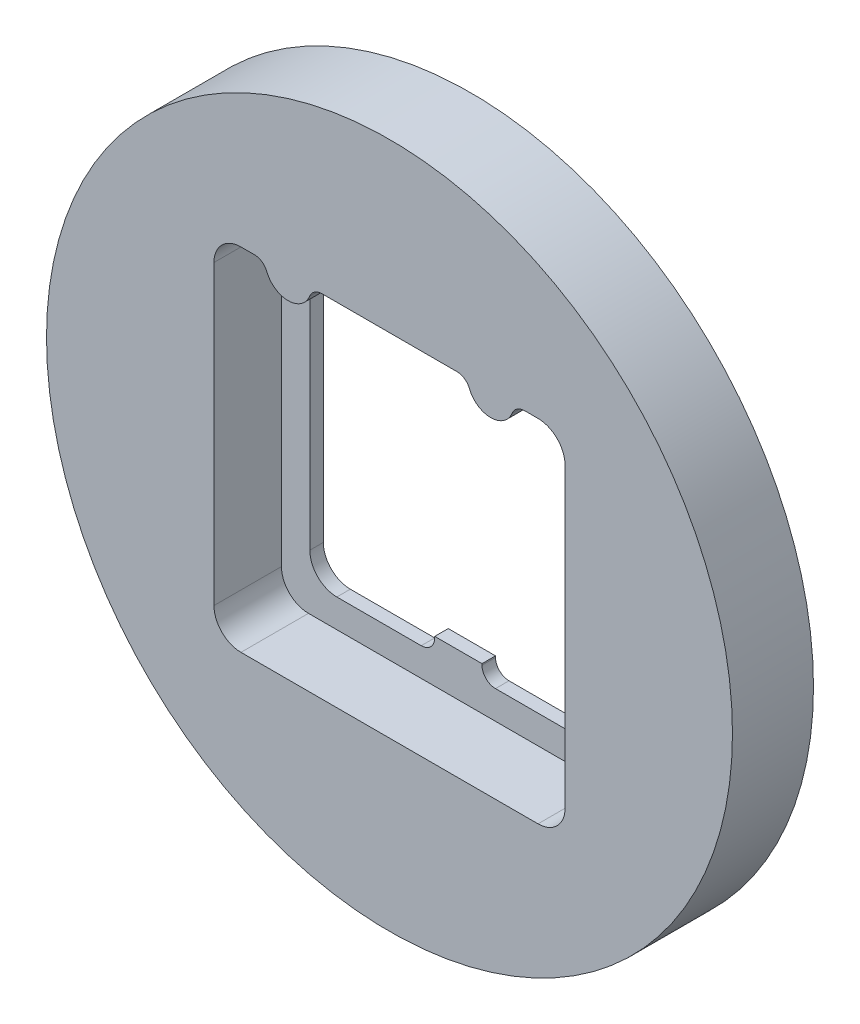
ISO-10303-21;
HEADER;
FILE_DESCRIPTION(('STEP AP214'),'2;1');
FILE_NAME('part.step','',(''),(''),'','','');
FILE_SCHEMA(('AUTOMOTIVE_DESIGN { 1 0 10303 214 1 1 1 1 }'));
ENDSEC;
DATA;
#1=APPLICATION_CONTEXT('core data for automotive mechanical design processes');
#2=APPLICATION_PROTOCOL_DEFINITION('international standard','automotive_design',2000,#1);
#3=PRODUCT_CONTEXT('',#1,'mechanical');
#4=PRODUCT('Part','Part','',(#3));
#5=PRODUCT_RELATED_PRODUCT_CATEGORY('part','',(#4));
#6=PRODUCT_DEFINITION_FORMATION('','',#4);
#7=PRODUCT_DEFINITION_CONTEXT('part definition',#1,'design');
#8=PRODUCT_DEFINITION('design','',#6,#7);
#9=PRODUCT_DEFINITION_SHAPE('','',#8);
#10=(LENGTH_UNIT() NAMED_UNIT(*) SI_UNIT(.MILLI.,.METRE.));
#11=(NAMED_UNIT(*) PLANE_ANGLE_UNIT() SI_UNIT($,.RADIAN.));
#12=(NAMED_UNIT(*) SI_UNIT($,.STERADIAN.) SOLID_ANGLE_UNIT());
#13=UNCERTAINTY_MEASURE_WITH_UNIT(LENGTH_MEASURE(1.E-05),#10,'distance_accuracy_value','');
#14=(GEOMETRIC_REPRESENTATION_CONTEXT(3) GLOBAL_UNCERTAINTY_ASSIGNED_CONTEXT((#13)) GLOBAL_UNIT_ASSIGNED_CONTEXT((#10,
#11,#12)) REPRESENTATION_CONTEXT('',''));
#15=CARTESIAN_POINT('',(0.,0.,0.));
#16=DIRECTION('',(0.,0.,1.));
#17=DIRECTION('',(1.,0.,0.));
#18=AXIS2_PLACEMENT_3D('',#15,#16,#17);
#19=CARTESIAN_POINT('',(0.,0.,6.));
#20=DIRECTION('',(0.,0.,-1.));
#21=DIRECTION('',(-1.,0.,0.));
#22=AXIS2_PLACEMENT_3D('',#19,#20,#21);
#23=CYLINDRICAL_SURFACE('',#22,25.4);
#24=CARTESIAN_POINT('',(0.,0.,6.));
#25=DIRECTION('',(0.,0.,1.));
#26=DIRECTION('',(1.,0.,0.));
#27=AXIS2_PLACEMENT_3D('',#24,#25,#26);
#28=CIRCLE('',#27,25.4);
#29=CARTESIAN_POINT('',(25.4,0.,6.));
#30=VERTEX_POINT('',#29);
#31=EDGE_CURVE('E11',#30,#30,#28,.T.);
#32=ORIENTED_EDGE('',*,*,#31,.F.);
#33=EDGE_LOOP('',(#32));
#34=FACE_BOUND('',#33,.T.);
#35=CARTESIAN_POINT('',(0.,0.,0.));
#36=DIRECTION('',(0.,0.,1.));
#37=DIRECTION('',(1.,0.,0.));
#38=AXIS2_PLACEMENT_3D('',#35,#36,#37);
#39=CIRCLE('',#38,25.4);
#40=CARTESIAN_POINT('',(25.4,0.,0.));
#41=VERTEX_POINT('',#40);
#42=EDGE_CURVE('E39',#41,#41,#39,.T.);
#43=ORIENTED_EDGE('',*,*,#42,.T.);
#44=EDGE_LOOP('',(#43));
#45=FACE_BOUND('',#44,.T.);
#46=ADVANCED_FACE('F36',(#34,#45),#23,.T.);
#47=CARTESIAN_POINT('',(0.,0.,6.));
#48=DIRECTION('',(0.,0.,1.));
#49=DIRECTION('',(1.,0.,0.));
#50=AXIS2_PLACEMENT_3D('',#47,#48,#49);
#51=PLANE('',#50);
#52=CARTESIAN_POINT('',(-4.99201275920311,12.,6.));
#53=DIRECTION('',(0.,0.,-1.));
#54=DIRECTION('',(-1.,0.,0.));
#55=AXIS2_PLACEMENT_3D('',#52,#53,#54);
#56=CIRCLE('',#55,1.);
#57=CARTESIAN_POINT('',(-5.92089692246122,12.3703703703704,6.));
#58=VERTEX_POINT('',#57);
#59=CARTESIAN_POINT('',(-4.99201275920311,13.,6.));
#60=VERTEX_POINT('',#59);
#61=EDGE_CURVE('E354',#58,#60,#56,.T.);
#62=ORIENTED_EDGE('',*,*,#61,.T.);
#63=DIRECTION('',(1.,0.,0.));
#64=VECTOR('',#63,1.);
#65=CARTESIAN_POINT('',(-4.99201275920311,13.,6.));
#66=LINE('',#65,#64);
#67=CARTESIAN_POINT('',(4.99201275920311,13.,6.));
#68=VERTEX_POINT('',#67);
#69=EDGE_CURVE('E327',#60,#68,#66,.T.);
#70=ORIENTED_EDGE('',*,*,#69,.T.);
#71=CARTESIAN_POINT('',(4.99201275920311,12.,6.));
#72=DIRECTION('',(0.,0.,1.));
#73=DIRECTION('',(1.,0.,0.));
#74=AXIS2_PLACEMENT_3D('',#71,#72,#73);
#75=CIRCLE('',#74,0.999999999999999);
#76=CARTESIAN_POINT('',(5.92089692246122,12.3703703703704,6.));
#77=VERTEX_POINT('',#76);
#78=EDGE_CURVE('E391',#77,#68,#75,.T.);
#79=ORIENTED_EDGE('',*,*,#78,.F.);
#80=CARTESIAN_POINT('',(7.5,13.,6.));
#81=DIRECTION('',(0.,0.,1.));
#82=DIRECTION('',(1.,0.,0.));
#83=AXIS2_PLACEMENT_3D('',#80,#81,#82);
#84=CIRCLE('',#83,1.7);
#85=CARTESIAN_POINT('',(9.07910307753878,12.3703703703704,6.));
#86=VERTEX_POINT('',#85);
#87=EDGE_CURVE('E394',#77,#86,#84,.T.);
#88=ORIENTED_EDGE('',*,*,#87,.T.);
#89=CARTESIAN_POINT('',(10.0079872407969,12.,6.));
#90=DIRECTION('',(0.,0.,-1.));
#91=DIRECTION('',(-1.,0.,0.));
#92=AXIS2_PLACEMENT_3D('',#89,#90,#91);
#93=CIRCLE('',#92,1.);
#94=CARTESIAN_POINT('',(10.0079872407969,13.,6.));
#95=VERTEX_POINT('',#94);
#96=EDGE_CURVE('E397',#86,#95,#93,.T.);
#97=ORIENTED_EDGE('',*,*,#96,.T.);
#98=DIRECTION('',(1.,0.,0.));
#99=VECTOR('',#98,1.);
#100=CARTESIAN_POINT('',(10.0079872407969,13.,6.));
#101=LINE('',#100,#99);
#102=CARTESIAN_POINT('',(11.,13.,6.));
#103=VERTEX_POINT('',#102);
#104=EDGE_CURVE('E400',#95,#103,#101,.T.);
#105=ORIENTED_EDGE('',*,*,#104,.T.);
#106=CARTESIAN_POINT('',(11.,11.,6.));
#107=DIRECTION('',(0.,0.,-1.));
#108=DIRECTION('',(-1.,0.,0.));
#109=AXIS2_PLACEMENT_3D('',#106,#107,#108);
#110=CIRCLE('',#109,2.);
#111=CARTESIAN_POINT('',(13.,11.,6.));
#112=VERTEX_POINT('',#111);
#113=EDGE_CURVE('E403',#103,#112,#110,.T.);
#114=ORIENTED_EDGE('',*,*,#113,.T.);
#115=DIRECTION('',(0.,1.,0.));
#116=VECTOR('',#115,1.);
#117=CARTESIAN_POINT('',(13.,-11.,6.));
#118=LINE('',#117,#116);
#119=CARTESIAN_POINT('',(13.,-11.,6.));
#120=VERTEX_POINT('',#119);
#121=EDGE_CURVE('E406',#120,#112,#118,.T.);
#122=ORIENTED_EDGE('',*,*,#121,.F.);
#123=CARTESIAN_POINT('',(11.,-11.,6.));
#124=DIRECTION('',(0.,0.,1.));
#125=DIRECTION('',(1.,0.,0.));
#126=AXIS2_PLACEMENT_3D('',#123,#124,#125);
#127=CIRCLE('',#126,2.);
#128=CARTESIAN_POINT('',(11.,-13.,6.));
#129=VERTEX_POINT('',#128);
#130=EDGE_CURVE('E409',#129,#120,#127,.T.);
#131=ORIENTED_EDGE('',*,*,#130,.F.);
#132=DIRECTION('',(1.,0.,0.));
#133=VECTOR('',#132,1.);
#134=CARTESIAN_POINT('',(-11.,-13.,6.));
#135=LINE('',#134,#133);
#136=CARTESIAN_POINT('',(-11.,-13.,6.));
#137=VERTEX_POINT('',#136);
#138=EDGE_CURVE('E412',#137,#129,#135,.T.);
#139=ORIENTED_EDGE('',*,*,#138,.F.);
#140=CARTESIAN_POINT('',(-11.,-11.,6.));
#141=DIRECTION('',(0.,0.,-1.));
#142=DIRECTION('',(-1.,0.,0.));
#143=AXIS2_PLACEMENT_3D('',#140,#141,#142);
#144=CIRCLE('',#143,2.);
#145=CARTESIAN_POINT('',(-13.,-11.,6.));
#146=VERTEX_POINT('',#145);
#147=EDGE_CURVE('E415',#137,#146,#144,.T.);
#148=ORIENTED_EDGE('',*,*,#147,.T.);
#149=DIRECTION('',(0.,1.,0.));
#150=VECTOR('',#149,1.);
#151=CARTESIAN_POINT('',(-13.,-11.,6.));
#152=LINE('',#151,#150);
#153=CARTESIAN_POINT('',(-13.,11.,6.));
#154=VERTEX_POINT('',#153);
#155=EDGE_CURVE('E418',#146,#154,#152,.T.);
#156=ORIENTED_EDGE('',*,*,#155,.T.);
#157=CARTESIAN_POINT('',(-11.,11.,6.));
#158=DIRECTION('',(0.,0.,-1.));
#159=DIRECTION('',(-1.,0.,0.));
#160=AXIS2_PLACEMENT_3D('',#157,#158,#159);
#161=CIRCLE('',#160,2.);
#162=CARTESIAN_POINT('',(-11.,13.,6.));
#163=VERTEX_POINT('',#162);
#164=EDGE_CURVE('E421',#154,#163,#161,.T.);
#165=ORIENTED_EDGE('',*,*,#164,.T.);
#166=DIRECTION('',(1.,0.,0.));
#167=VECTOR('',#166,1.);
#168=CARTESIAN_POINT('',(-11.,13.,6.));
#169=LINE('',#168,#167);
#170=CARTESIAN_POINT('',(-10.0079872407969,13.,6.));
#171=VERTEX_POINT('',#170);
#172=EDGE_CURVE('E424',#163,#171,#169,.T.);
#173=ORIENTED_EDGE('',*,*,#172,.T.);
#174=CARTESIAN_POINT('',(-10.0079872407969,12.,6.));
#175=DIRECTION('',(0.,0.,-1.));
#176=DIRECTION('',(-1.,0.,0.));
#177=AXIS2_PLACEMENT_3D('',#174,#175,#176);
#178=CIRCLE('',#177,1.);
#179=CARTESIAN_POINT('',(-9.07910307753878,12.3703703703704,6.));
#180=VERTEX_POINT('',#179);
#181=EDGE_CURVE('E427',#171,#180,#178,.T.);
#182=ORIENTED_EDGE('',*,*,#181,.T.);
#183=CARTESIAN_POINT('',(-7.5,13.,6.));
#184=DIRECTION('',(0.,0.,1.));
#185=DIRECTION('',(1.,0.,0.));
#186=AXIS2_PLACEMENT_3D('',#183,#184,#185);
#187=CIRCLE('',#186,1.7);
#188=EDGE_CURVE('E430',#180,#58,#187,.T.);
#189=ORIENTED_EDGE('',*,*,#188,.T.);
#190=EDGE_LOOP('',(#62,#70,#79,#88,#97,#105,#114,#122,#131,#139,#148,#156,#165,#173,#182,#189));
#191=FACE_BOUND('',#190,.T.);
#192=ORIENTED_EDGE('',*,*,#31,.T.);
#193=EDGE_LOOP('',(#192));
#194=FACE_BOUND('',#193,.T.);
#195=ADVANCED_FACE('F473',(#191,#194),#51,.T.);
#196=CARTESIAN_POINT('',(0.,0.,0.));
#197=DIRECTION('',(0.,0.,1.));
#198=DIRECTION('',(1.,0.,0.));
#199=AXIS2_PLACEMENT_3D('',#196,#197,#198);
#200=PLANE('',#199);
#201=DIRECTION('',(0.,-1.,0.));
#202=VECTOR('',#201,1.);
#203=CARTESIAN_POINT('',(-10.9,-8.9,0.));
#204=LINE('',#203,#202);
#205=CARTESIAN_POINT('',(-10.9,9.1,0.));
#206=VERTEX_POINT('',#205);
#207=CARTESIAN_POINT('',(-10.9,-8.9,0.));
#208=VERTEX_POINT('',#207);
#209=EDGE_CURVE('E244',#206,#208,#204,.T.);
#210=ORIENTED_EDGE('',*,*,#209,.T.);
#211=CARTESIAN_POINT('',(-8.9,-8.9,0.));
#212=DIRECTION('',(0.,0.,1.));
#213=DIRECTION('',(1.,0.,0.));
#214=AXIS2_PLACEMENT_3D('',#211,#212,#213);
#215=CIRCLE('',#214,2.);
#216=CARTESIAN_POINT('',(-8.9,-10.9,0.));
#217=VERTEX_POINT('',#216);
#218=EDGE_CURVE('E236',#208,#217,#215,.T.);
#219=ORIENTED_EDGE('',*,*,#218,.T.);
#220=DIRECTION('',(1.,0.,0.));
#221=VECTOR('',#220,1.);
#222=CARTESIAN_POINT('',(-8.9,-10.9,0.));
#223=LINE('',#222,#221);
#224=CARTESIAN_POINT('',(-2.64999999999999,-10.9,0.));
#225=VERTEX_POINT('',#224);
#226=EDGE_CURVE('E247',#217,#225,#223,.T.);
#227=ORIENTED_EDGE('',*,*,#226,.T.);
#228=CARTESIAN_POINT('',(-2.64999999999999,-9.9,0.));
#229=DIRECTION('',(0.,0.,1.));
#230=DIRECTION('',(-1.,0.,0.));
#231=AXIS2_PLACEMENT_3D('',#228,#229,#230);
#232=CIRCLE('',#231,0.999999999999999);
#233=CARTESIAN_POINT('',(-1.64999999999999,-9.9,0.));
#234=VERTEX_POINT('',#233);
#235=EDGE_CURVE('E58',#225,#234,#232,.T.);
#236=ORIENTED_EDGE('',*,*,#235,.T.);
#237=DIRECTION('',(0.,1.,0.));
#238=VECTOR('',#237,1.);
#239=CARTESIAN_POINT('',(-1.64999999999999,-9.79999999999999,0.));
#240=LINE('',#239,#238);
#241=CARTESIAN_POINT('',(-1.64999999999999,-9.79999999999999,0.));
#242=VERTEX_POINT('',#241);
#243=EDGE_CURVE('E261',#234,#242,#240,.T.);
#244=ORIENTED_EDGE('',*,*,#243,.T.);
#245=DIRECTION('',(1.,0.,0.));
#246=VECTOR('',#245,1.);
#247=CARTESIAN_POINT('',(-1.64999999999999,-9.79999999999999,0.));
#248=LINE('',#247,#246);
#249=CARTESIAN_POINT('',(1.85000000000001,-9.79999999999999,0.));
#250=VERTEX_POINT('',#249);
#251=EDGE_CURVE('E264',#242,#250,#248,.T.);
#252=ORIENTED_EDGE('',*,*,#251,.T.);
#253=DIRECTION('',(0.,-1.,0.));
#254=VECTOR('',#253,1.);
#255=CARTESIAN_POINT('',(1.85000000000001,-9.79999999999999,0.));
#256=LINE('',#255,#254);
#257=CARTESIAN_POINT('',(1.85000000000001,-9.9,0.));
#258=VERTEX_POINT('',#257);
#259=EDGE_CURVE('E267',#250,#258,#256,.T.);
#260=ORIENTED_EDGE('',*,*,#259,.T.);
#261=CARTESIAN_POINT('',(2.85000000000001,-9.9,0.));
#262=DIRECTION('',(0.,0.,1.));
#263=DIRECTION('',(-1.,0.,0.));
#264=AXIS2_PLACEMENT_3D('',#261,#262,#263);
#265=CIRCLE('',#264,0.999999999999998);
#266=CARTESIAN_POINT('',(2.85000000000001,-10.9,0.));
#267=VERTEX_POINT('',#266);
#268=EDGE_CURVE('E270',#258,#267,#265,.T.);
#269=ORIENTED_EDGE('',*,*,#268,.T.);
#270=DIRECTION('',(1.,0.,0.));
#271=VECTOR('',#270,1.);
#272=CARTESIAN_POINT('',(2.85000000000001,-10.9,0.));
#273=LINE('',#272,#271);
#274=CARTESIAN_POINT('',(9.1,-10.9,0.));
#275=VERTEX_POINT('',#274);
#276=EDGE_CURVE('E273',#267,#275,#273,.T.);
#277=ORIENTED_EDGE('',*,*,#276,.T.);
#278=CARTESIAN_POINT('',(9.1,-8.9,0.));
#279=DIRECTION('',(0.,0.,1.));
#280=DIRECTION('',(-1.,0.,0.));
#281=AXIS2_PLACEMENT_3D('',#278,#279,#280);
#282=CIRCLE('',#281,2.);
#283=CARTESIAN_POINT('',(11.1,-8.9,0.));
#284=VERTEX_POINT('',#283);
#285=EDGE_CURVE('E276',#275,#284,#282,.T.);
#286=ORIENTED_EDGE('',*,*,#285,.T.);
#287=DIRECTION('',(0.,1.,0.));
#288=VECTOR('',#287,1.);
#289=CARTESIAN_POINT('',(11.1,-8.9,0.));
#290=LINE('',#289,#288);
#291=CARTESIAN_POINT('',(11.1,9.1,0.));
#292=VERTEX_POINT('',#291);
#293=EDGE_CURVE('E279',#284,#292,#290,.T.);
#294=ORIENTED_EDGE('',*,*,#293,.T.);
#295=CARTESIAN_POINT('',(9.1,9.1,0.));
#296=DIRECTION('',(0.,0.,1.));
#297=DIRECTION('',(-1.,0.,0.));
#298=AXIS2_PLACEMENT_3D('',#295,#296,#297);
#299=CIRCLE('',#298,2.);
#300=CARTESIAN_POINT('',(9.1,11.1,0.));
#301=VERTEX_POINT('',#300);
#302=EDGE_CURVE('E282',#292,#301,#299,.T.);
#303=ORIENTED_EDGE('',*,*,#302,.T.);
#304=DIRECTION('',(-1.,0.,0.));
#305=VECTOR('',#304,1.);
#306=CARTESIAN_POINT('',(-8.9,11.1,0.));
#307=LINE('',#306,#305);
#308=CARTESIAN_POINT('',(-8.9,11.1,0.));
#309=VERTEX_POINT('',#308);
#310=EDGE_CURVE('E285',#301,#309,#307,.T.);
#311=ORIENTED_EDGE('',*,*,#310,.T.);
#312=CARTESIAN_POINT('',(-8.9,9.1,0.));
#313=DIRECTION('',(0.,0.,1.));
#314=DIRECTION('',(-1.,0.,0.));
#315=AXIS2_PLACEMENT_3D('',#312,#313,#314);
#316=CIRCLE('',#315,2.);
#317=EDGE_CURVE('E288',#309,#206,#316,.T.);
#318=ORIENTED_EDGE('',*,*,#317,.T.);
#319=EDGE_LOOP('',(#210,#219,#227,#236,#244,#252,#260,#269,#277,#286,#294,#303,#311,#318));
#320=FACE_BOUND('',#319,.T.);
#321=ORIENTED_EDGE('',*,*,#42,.F.);
#322=EDGE_LOOP('',(#321));
#323=FACE_BOUND('',#322,.T.);
#324=ADVANCED_FACE('F251',(#320,#323),#200,.F.);
#325=CARTESIAN_POINT('',(-4.99201275920311,13.,1.));
#326=DIRECTION('',(0.,-1.,0.));
#327=DIRECTION('',(0.,0.,-1.));
#328=AXIS2_PLACEMENT_3D('',#325,#326,#327);
#329=PLANE('',#328);
#330=ORIENTED_EDGE('',*,*,#69,.F.);
#331=DIRECTION('',(0.,0.,1.));
#332=VECTOR('',#331,1.);
#333=CARTESIAN_POINT('',(-4.99201275920311,13.,1.));
#334=LINE('',#333,#332);
#335=CARTESIAN_POINT('',(-4.99201275920311,13.,1.));
#336=VERTEX_POINT('',#335);
#337=EDGE_CURVE('E388',#336,#60,#334,.T.);
#338=ORIENTED_EDGE('',*,*,#337,.F.);
#339=DIRECTION('',(1.,0.,0.));
#340=VECTOR('',#339,1.);
#341=CARTESIAN_POINT('',(-4.99201275920311,13.,1.));
#342=LINE('',#341,#340);
#343=CARTESIAN_POINT('',(4.99201275920311,13.,1.));
#344=VERTEX_POINT('',#343);
#345=EDGE_CURVE('E351',#336,#344,#342,.T.);
#346=ORIENTED_EDGE('',*,*,#345,.T.);
#347=DIRECTION('',(0.,0.,1.));
#348=VECTOR('',#347,1.);
#349=CARTESIAN_POINT('',(4.99201275920311,13.,1.));
#350=LINE('',#349,#348);
#351=EDGE_CURVE('E465',#344,#68,#350,.T.);
#352=ORIENTED_EDGE('',*,*,#351,.T.);
#353=EDGE_LOOP('',(#330,#338,#346,#352));
#354=FACE_BOUND('',#353,.T.);
#355=ADVANCED_FACE('F472',(#354),#329,.T.);
#356=CARTESIAN_POINT('',(4.99201275920311,12.,1.));
#357=DIRECTION('',(0.,0.,1.));
#358=DIRECTION('',(1.,0.,0.));
#359=AXIS2_PLACEMENT_3D('',#356,#357,#358);
#360=CYLINDRICAL_SURFACE('',#359,0.999999999999999);
#361=ORIENTED_EDGE('',*,*,#78,.T.);
#362=ORIENTED_EDGE('',*,*,#351,.F.);
#363=CARTESIAN_POINT('',(4.99201275920311,12.,1.));
#364=DIRECTION('',(0.,0.,1.));
#365=DIRECTION('',(1.,0.,0.));
#366=AXIS2_PLACEMENT_3D('',#363,#364,#365);
#367=CIRCLE('',#366,0.999999999999999);
#368=CARTESIAN_POINT('',(5.92089692246122,12.3703703703704,1.));
#369=VERTEX_POINT('',#368);
#370=EDGE_CURVE('E353',#369,#344,#367,.T.);
#371=ORIENTED_EDGE('',*,*,#370,.F.);
#372=DIRECTION('',(0.,0.,1.));
#373=VECTOR('',#372,1.);
#374=CARTESIAN_POINT('',(5.92089692246122,12.3703703703704,1.));
#375=LINE('',#374,#373);
#376=EDGE_CURVE('E463',#369,#77,#375,.T.);
#377=ORIENTED_EDGE('',*,*,#376,.T.);
#378=EDGE_LOOP('',(#361,#362,#371,#377));
#379=FACE_BOUND('',#378,.T.);
#380=ADVANCED_FACE('F478',(#379),#360,.F.);
#381=CARTESIAN_POINT('',(7.5,13.,1.));
#382=DIRECTION('',(0.,0.,1.));
#383=DIRECTION('',(1.,0.,0.));
#384=AXIS2_PLACEMENT_3D('',#381,#382,#383);
#385=CYLINDRICAL_SURFACE('',#384,1.7);
#386=ORIENTED_EDGE('',*,*,#87,.F.);
#387=ORIENTED_EDGE('',*,*,#376,.F.);
#388=CARTESIAN_POINT('',(7.5,13.,1.));
#389=DIRECTION('',(0.,0.,1.));
#390=DIRECTION('',(1.,0.,0.));
#391=AXIS2_PLACEMENT_3D('',#388,#389,#390);
#392=CIRCLE('',#391,1.7);
#393=CARTESIAN_POINT('',(9.07910307753878,12.3703703703704,1.));
#394=VERTEX_POINT('',#393);
#395=EDGE_CURVE('E357',#369,#394,#392,.T.);
#396=ORIENTED_EDGE('',*,*,#395,.T.);
#397=DIRECTION('',(0.,0.,1.));
#398=VECTOR('',#397,1.);
#399=CARTESIAN_POINT('',(9.07910307753878,12.3703703703704,1.));
#400=LINE('',#399,#398);
#401=EDGE_CURVE('E461',#394,#86,#400,.T.);
#402=ORIENTED_EDGE('',*,*,#401,.T.);
#403=EDGE_LOOP('',(#386,#387,#396,#402));
#404=FACE_BOUND('',#403,.T.);
#405=ADVANCED_FACE('F530',(#404),#385,.T.);
#406=CARTESIAN_POINT('',(10.0079872407969,12.,1.));
#407=DIRECTION('',(0.,0.,1.));
#408=DIRECTION('',(1.,0.,0.));
#409=AXIS2_PLACEMENT_3D('',#406,#407,#408);
#410=CYLINDRICAL_SURFACE('',#409,1.);
#411=ORIENTED_EDGE('',*,*,#96,.F.);
#412=ORIENTED_EDGE('',*,*,#401,.F.);
#413=CARTESIAN_POINT('',(10.0079872407969,12.,1.));
#414=DIRECTION('',(0.,0.,-1.));
#415=DIRECTION('',(-1.,0.,0.));
#416=AXIS2_PLACEMENT_3D('',#413,#414,#415);
#417=CIRCLE('',#416,1.);
#418=CARTESIAN_POINT('',(10.0079872407969,13.,1.));
#419=VERTEX_POINT('',#418);
#420=EDGE_CURVE('E359',#394,#419,#417,.T.);
#421=ORIENTED_EDGE('',*,*,#420,.T.);
#422=DIRECTION('',(0.,0.,1.));
#423=VECTOR('',#422,1.);
#424=CARTESIAN_POINT('',(10.0079872407969,13.,1.));
#425=LINE('',#424,#423);
#426=EDGE_CURVE('E459',#419,#95,#425,.T.);
#427=ORIENTED_EDGE('',*,*,#426,.T.);
#428=EDGE_LOOP('',(#411,#412,#421,#427));
#429=FACE_BOUND('',#428,.T.);
#430=ADVANCED_FACE('F540',(#429),#410,.F.);
#431=CARTESIAN_POINT('',(10.0079872407969,13.,1.));
#432=DIRECTION('',(0.,-1.,0.));
#433=DIRECTION('',(0.,0.,-1.));
#434=AXIS2_PLACEMENT_3D('',#431,#432,#433);
#435=PLANE('',#434);
#436=ORIENTED_EDGE('',*,*,#104,.F.);
#437=ORIENTED_EDGE('',*,*,#426,.F.);
#438=DIRECTION('',(1.,0.,0.));
#439=VECTOR('',#438,1.);
#440=CARTESIAN_POINT('',(10.0079872407969,13.,1.));
#441=LINE('',#440,#439);
#442=CARTESIAN_POINT('',(11.,13.,1.));
#443=VERTEX_POINT('',#442);
#444=EDGE_CURVE('E361',#419,#443,#441,.T.);
#445=ORIENTED_EDGE('',*,*,#444,.T.);
#446=DIRECTION('',(0.,0.,1.));
#447=VECTOR('',#446,1.);
#448=CARTESIAN_POINT('',(11.,13.,1.));
#449=LINE('',#448,#447);
#450=EDGE_CURVE('E457',#443,#103,#449,.T.);
#451=ORIENTED_EDGE('',*,*,#450,.T.);
#452=EDGE_LOOP('',(#436,#437,#445,#451));
#453=FACE_BOUND('',#452,.T.);
#454=ADVANCED_FACE('F581',(#453),#435,.T.);
#455=CARTESIAN_POINT('',(11.,11.,1.));
#456=DIRECTION('',(0.,0.,1.));
#457=DIRECTION('',(1.,0.,0.));
#458=AXIS2_PLACEMENT_3D('',#455,#456,#457);
#459=CYLINDRICAL_SURFACE('',#458,2.);
#460=ORIENTED_EDGE('',*,*,#113,.F.);
#461=ORIENTED_EDGE('',*,*,#450,.F.);
#462=CARTESIAN_POINT('',(11.,11.,1.));
#463=DIRECTION('',(0.,0.,-1.));
#464=DIRECTION('',(-1.,0.,0.));
#465=AXIS2_PLACEMENT_3D('',#462,#463,#464);
#466=CIRCLE('',#465,2.);
#467=CARTESIAN_POINT('',(13.,11.,1.));
#468=VERTEX_POINT('',#467);
#469=EDGE_CURVE('E363',#443,#468,#466,.T.);
#470=ORIENTED_EDGE('',*,*,#469,.T.);
#471=DIRECTION('',(0.,0.,1.));
#472=VECTOR('',#471,1.);
#473=CARTESIAN_POINT('',(13.,11.,1.));
#474=LINE('',#473,#472);
#475=EDGE_CURVE('E455',#468,#112,#474,.T.);
#476=ORIENTED_EDGE('',*,*,#475,.T.);
#477=EDGE_LOOP('',(#460,#461,#470,#476));
#478=FACE_BOUND('',#477,.T.);
#479=ADVANCED_FACE('F591',(#478),#459,.F.);
#480=CARTESIAN_POINT('',(13.,-11.,1.));
#481=DIRECTION('',(1.,0.,0.));
#482=DIRECTION('',(0.,0.,-1.));
#483=AXIS2_PLACEMENT_3D('',#480,#481,#482);
#484=PLANE('',#483);
#485=ORIENTED_EDGE('',*,*,#121,.T.);
#486=ORIENTED_EDGE('',*,*,#475,.F.);
#487=DIRECTION('',(0.,1.,0.));
#488=VECTOR('',#487,1.);
#489=CARTESIAN_POINT('',(13.,-11.,1.));
#490=LINE('',#489,#488);
#491=CARTESIAN_POINT('',(13.,-11.,1.));
#492=VERTEX_POINT('',#491);
#493=EDGE_CURVE('E365',#492,#468,#490,.T.);
#494=ORIENTED_EDGE('',*,*,#493,.F.);
#495=DIRECTION('',(0.,0.,1.));
#496=VECTOR('',#495,1.);
#497=CARTESIAN_POINT('',(13.,-11.,1.));
#498=LINE('',#497,#496);
#499=EDGE_CURVE('E453',#492,#120,#498,.T.);
#500=ORIENTED_EDGE('',*,*,#499,.T.);
#501=EDGE_LOOP('',(#485,#486,#494,#500));
#502=FACE_BOUND('',#501,.T.);
#503=ADVANCED_FACE('F601',(#502),#484,.F.);
#504=CARTESIAN_POINT('',(11.,-11.,1.));
#505=DIRECTION('',(0.,0.,1.));
#506=DIRECTION('',(1.,0.,0.));
#507=AXIS2_PLACEMENT_3D('',#504,#505,#506);
#508=CYLINDRICAL_SURFACE('',#507,2.);
#509=ORIENTED_EDGE('',*,*,#130,.T.);
#510=ORIENTED_EDGE('',*,*,#499,.F.);
#511=CARTESIAN_POINT('',(11.,-11.,1.));
#512=DIRECTION('',(0.,0.,1.));
#513=DIRECTION('',(1.,0.,0.));
#514=AXIS2_PLACEMENT_3D('',#511,#512,#513);
#515=CIRCLE('',#514,2.);
#516=CARTESIAN_POINT('',(11.,-13.,1.));
#517=VERTEX_POINT('',#516);
#518=EDGE_CURVE('E368',#517,#492,#515,.T.);
#519=ORIENTED_EDGE('',*,*,#518,.F.);
#520=DIRECTION('',(0.,0.,1.));
#521=VECTOR('',#520,1.);
#522=CARTESIAN_POINT('',(11.,-13.,1.));
#523=LINE('',#522,#521);
#524=EDGE_CURVE('E451',#517,#129,#523,.T.);
#525=ORIENTED_EDGE('',*,*,#524,.T.);
#526=EDGE_LOOP('',(#509,#510,#519,#525));
#527=FACE_BOUND('',#526,.T.);
#528=ADVANCED_FACE('F626',(#527),#508,.F.);
#529=CARTESIAN_POINT('',(-11.,-13.,1.));
#530=DIRECTION('',(0.,-1.,0.));
#531=DIRECTION('',(0.,0.,-1.));
#532=AXIS2_PLACEMENT_3D('',#529,#530,#531);
#533=PLANE('',#532);
#534=ORIENTED_EDGE('',*,*,#138,.T.);
#535=ORIENTED_EDGE('',*,*,#524,.F.);
#536=DIRECTION('',(1.,0.,0.));
#537=VECTOR('',#536,1.);
#538=CARTESIAN_POINT('',(-11.,-13.,1.));
#539=LINE('',#538,#537);
#540=CARTESIAN_POINT('',(-11.,-13.,1.));
#541=VERTEX_POINT('',#540);
#542=EDGE_CURVE('E371',#541,#517,#539,.T.);
#543=ORIENTED_EDGE('',*,*,#542,.F.);
#544=DIRECTION('',(0.,0.,1.));
#545=VECTOR('',#544,1.);
#546=CARTESIAN_POINT('',(-11.,-13.,1.));
#547=LINE('',#546,#545);
#548=EDGE_CURVE('E449',#541,#137,#547,.T.);
#549=ORIENTED_EDGE('',*,*,#548,.T.);
#550=EDGE_LOOP('',(#534,#535,#543,#549));
#551=FACE_BOUND('',#550,.T.);
#552=ADVANCED_FACE('F652',(#551),#533,.F.);
#553=CARTESIAN_POINT('',(-11.,-11.,1.));
#554=DIRECTION('',(0.,0.,1.));
#555=DIRECTION('',(1.,0.,0.));
#556=AXIS2_PLACEMENT_3D('',#553,#554,#555);
#557=CYLINDRICAL_SURFACE('',#556,2.);
#558=ORIENTED_EDGE('',*,*,#147,.F.);
#559=ORIENTED_EDGE('',*,*,#548,.F.);
#560=CARTESIAN_POINT('',(-11.,-11.,1.));
#561=DIRECTION('',(0.,0.,-1.));
#562=DIRECTION('',(-1.,0.,0.));
#563=AXIS2_PLACEMENT_3D('',#560,#561,#562);
#564=CIRCLE('',#563,2.);
#565=CARTESIAN_POINT('',(-13.,-11.,1.));
#566=VERTEX_POINT('',#565);
#567=EDGE_CURVE('E374',#541,#566,#564,.T.);
#568=ORIENTED_EDGE('',*,*,#567,.T.);
#569=DIRECTION('',(0.,0.,1.));
#570=VECTOR('',#569,1.);
#571=CARTESIAN_POINT('',(-13.,-11.,1.));
#572=LINE('',#571,#570);
#573=EDGE_CURVE('E447',#566,#146,#572,.T.);
#574=ORIENTED_EDGE('',*,*,#573,.T.);
#575=EDGE_LOOP('',(#558,#559,#568,#574));
#576=FACE_BOUND('',#575,.T.);
#577=ADVANCED_FACE('F688',(#576),#557,.F.);
#578=CARTESIAN_POINT('',(-13.,-11.,1.));
#579=DIRECTION('',(1.,0.,0.));
#580=DIRECTION('',(0.,0.,-1.));
#581=AXIS2_PLACEMENT_3D('',#578,#579,#580);
#582=PLANE('',#581);
#583=ORIENTED_EDGE('',*,*,#155,.F.);
#584=ORIENTED_EDGE('',*,*,#573,.F.);
#585=DIRECTION('',(0.,1.,0.));
#586=VECTOR('',#585,1.);
#587=CARTESIAN_POINT('',(-13.,-11.,1.));
#588=LINE('',#587,#586);
#589=CARTESIAN_POINT('',(-13.,11.,1.));
#590=VERTEX_POINT('',#589);
#591=EDGE_CURVE('E376',#566,#590,#588,.T.);
#592=ORIENTED_EDGE('',*,*,#591,.T.);
#593=DIRECTION('',(0.,0.,1.));
#594=VECTOR('',#593,1.);
#595=CARTESIAN_POINT('',(-13.,11.,1.));
#596=LINE('',#595,#594);
#597=EDGE_CURVE('E445',#590,#154,#596,.T.);
#598=ORIENTED_EDGE('',*,*,#597,.T.);
#599=EDGE_LOOP('',(#583,#584,#592,#598));
#600=FACE_BOUND('',#599,.T.);
#601=ADVANCED_FACE('F554',(#600),#582,.T.);
#602=CARTESIAN_POINT('',(-11.,11.,1.));
#603=DIRECTION('',(0.,0.,1.));
#604=DIRECTION('',(1.,0.,0.));
#605=AXIS2_PLACEMENT_3D('',#602,#603,#604);
#606=CYLINDRICAL_SURFACE('',#605,2.);
#607=ORIENTED_EDGE('',*,*,#164,.F.);
#608=ORIENTED_EDGE('',*,*,#597,.F.);
#609=CARTESIAN_POINT('',(-11.,11.,1.));
#610=DIRECTION('',(0.,0.,-1.));
#611=DIRECTION('',(-1.,0.,0.));
#612=AXIS2_PLACEMENT_3D('',#609,#610,#611);
#613=CIRCLE('',#612,2.);
#614=CARTESIAN_POINT('',(-11.,13.,1.));
#615=VERTEX_POINT('',#614);
#616=EDGE_CURVE('E378',#590,#615,#613,.T.);
#617=ORIENTED_EDGE('',*,*,#616,.T.);
#618=DIRECTION('',(0.,0.,1.));
#619=VECTOR('',#618,1.);
#620=CARTESIAN_POINT('',(-11.,13.,1.));
#621=LINE('',#620,#619);
#622=EDGE_CURVE('E443',#615,#163,#621,.T.);
#623=ORIENTED_EDGE('',*,*,#622,.T.);
#624=EDGE_LOOP('',(#607,#608,#617,#623));
#625=FACE_BOUND('',#624,.T.);
#626=ADVANCED_FACE('F548',(#625),#606,.F.);
#627=CARTESIAN_POINT('',(-11.,13.,1.));
#628=DIRECTION('',(0.,-1.,0.));
#629=DIRECTION('',(0.,0.,-1.));
#630=AXIS2_PLACEMENT_3D('',#627,#628,#629);
#631=PLANE('',#630);
#632=ORIENTED_EDGE('',*,*,#172,.F.);
#633=ORIENTED_EDGE('',*,*,#622,.F.);
#634=DIRECTION('',(1.,0.,0.));
#635=VECTOR('',#634,1.);
#636=CARTESIAN_POINT('',(-11.,13.,1.));
#637=LINE('',#636,#635);
#638=CARTESIAN_POINT('',(-10.0079872407969,13.,1.));
#639=VERTEX_POINT('',#638);
#640=EDGE_CURVE('E380',#615,#639,#637,.T.);
#641=ORIENTED_EDGE('',*,*,#640,.T.);
#642=DIRECTION('',(0.,0.,1.));
#643=VECTOR('',#642,1.);
#644=CARTESIAN_POINT('',(-10.0079872407969,13.,1.));
#645=LINE('',#644,#643);
#646=EDGE_CURVE('E441',#639,#171,#645,.T.);
#647=ORIENTED_EDGE('',*,*,#646,.T.);
#648=EDGE_LOOP('',(#632,#633,#641,#647));
#649=FACE_BOUND('',#648,.T.);
#650=ADVANCED_FACE('F553',(#649),#631,.T.);
#651=CARTESIAN_POINT('',(-10.0079872407969,12.,1.));
#652=DIRECTION('',(0.,0.,1.));
#653=DIRECTION('',(1.,0.,0.));
#654=AXIS2_PLACEMENT_3D('',#651,#652,#653);
#655=CYLINDRICAL_SURFACE('',#654,1.);
#656=ORIENTED_EDGE('',*,*,#181,.F.);
#657=ORIENTED_EDGE('',*,*,#646,.F.);
#658=CARTESIAN_POINT('',(-10.0079872407969,12.,1.));
#659=DIRECTION('',(0.,0.,-1.));
#660=DIRECTION('',(-1.,0.,0.));
#661=AXIS2_PLACEMENT_3D('',#658,#659,#660);
#662=CIRCLE('',#661,1.);
#663=CARTESIAN_POINT('',(-9.07910307753878,12.3703703703704,1.));
#664=VERTEX_POINT('',#663);
#665=EDGE_CURVE('E382',#639,#664,#662,.T.);
#666=ORIENTED_EDGE('',*,*,#665,.T.);
#667=DIRECTION('',(0.,0.,1.));
#668=VECTOR('',#667,1.);
#669=CARTESIAN_POINT('',(-9.07910307753878,12.3703703703704,1.));
#670=LINE('',#669,#668);
#671=EDGE_CURVE('E439',#664,#180,#670,.T.);
#672=ORIENTED_EDGE('',*,*,#671,.T.);
#673=EDGE_LOOP('',(#656,#657,#666,#672));
#674=FACE_BOUND('',#673,.T.);
#675=ADVANCED_FACE('F615',(#674),#655,.F.);
#676=CARTESIAN_POINT('',(-7.5,13.,1.));
#677=DIRECTION('',(0.,0.,1.));
#678=DIRECTION('',(1.,0.,0.));
#679=AXIS2_PLACEMENT_3D('',#676,#677,#678);
#680=CYLINDRICAL_SURFACE('',#679,1.7);
#681=ORIENTED_EDGE('',*,*,#188,.F.);
#682=ORIENTED_EDGE('',*,*,#671,.F.);
#683=CARTESIAN_POINT('',(-7.5,13.,1.));
#684=DIRECTION('',(0.,0.,1.));
#685=DIRECTION('',(1.,0.,0.));
#686=AXIS2_PLACEMENT_3D('',#683,#684,#685);
#687=CIRCLE('',#686,1.7);
#688=CARTESIAN_POINT('',(-5.92089692246122,12.3703703703704,1.));
#689=VERTEX_POINT('',#688);
#690=EDGE_CURVE('E384',#664,#689,#687,.T.);
#691=ORIENTED_EDGE('',*,*,#690,.T.);
#692=DIRECTION('',(0.,0.,1.));
#693=VECTOR('',#692,1.);
#694=CARTESIAN_POINT('',(-5.92089692246122,12.3703703703704,1.));
#695=LINE('',#694,#693);
#696=EDGE_CURVE('E437',#689,#58,#695,.T.);
#697=ORIENTED_EDGE('',*,*,#696,.T.);
#698=EDGE_LOOP('',(#681,#682,#691,#697));
#699=FACE_BOUND('',#698,.T.);
#700=ADVANCED_FACE('F609',(#699),#680,.T.);
#701=CARTESIAN_POINT('',(-4.99201275920311,12.,1.));
#702=DIRECTION('',(0.,0.,1.));
#703=DIRECTION('',(1.,0.,0.));
#704=AXIS2_PLACEMENT_3D('',#701,#702,#703);
#705=CYLINDRICAL_SURFACE('',#704,1.);
#706=ORIENTED_EDGE('',*,*,#61,.F.);
#707=ORIENTED_EDGE('',*,*,#696,.F.);
#708=CARTESIAN_POINT('',(-4.99201275920311,12.,1.));
#709=DIRECTION('',(0.,0.,-1.));
#710=DIRECTION('',(-1.,0.,0.));
#711=AXIS2_PLACEMENT_3D('',#708,#709,#710);
#712=CIRCLE('',#711,1.);
#713=EDGE_CURVE('E386',#689,#336,#712,.T.);
#714=ORIENTED_EDGE('',*,*,#713,.T.);
#715=ORIENTED_EDGE('',*,*,#337,.T.);
#716=EDGE_LOOP('',(#706,#707,#714,#715));
#717=FACE_BOUND('',#716,.T.);
#718=ADVANCED_FACE('F614',(#717),#705,.F.);
#719=CARTESIAN_POINT('',(4.99201275920311,12.,1.));
#720=DIRECTION('',(0.,0.,1.));
#721=DIRECTION('',(1.,0.,0.));
#722=AXIS2_PLACEMENT_3D('',#719,#720,#721);
#723=PLANE('',#722);
#724=CARTESIAN_POINT('',(-8.9,-8.9,1.));
#725=DIRECTION('',(0.,0.,1.));
#726=DIRECTION('',(1.,0.,0.));
#727=AXIS2_PLACEMENT_3D('',#724,#725,#726);
#728=CIRCLE('',#727,2.);
#729=CARTESIAN_POINT('',(-10.9,-8.9,1.));
#730=VERTEX_POINT('',#729);
#731=CARTESIAN_POINT('',(-8.9,-10.9,1.));
#732=VERTEX_POINT('',#731);
#733=EDGE_CURVE('E239',#730,#732,#728,.T.);
#734=ORIENTED_EDGE('',*,*,#733,.F.);
#735=DIRECTION('',(0.,-1.,0.));
#736=VECTOR('',#735,1.);
#737=CARTESIAN_POINT('',(-10.9,-8.9,1.));
#738=LINE('',#737,#736);
#739=CARTESIAN_POINT('',(-10.9,9.1,1.));
#740=VERTEX_POINT('',#739);
#741=EDGE_CURVE('E255',#740,#730,#738,.T.);
#742=ORIENTED_EDGE('',*,*,#741,.F.);
#743=CARTESIAN_POINT('',(-8.9,9.1,1.));
#744=DIRECTION('',(0.,0.,1.));
#745=DIRECTION('',(-1.,0.,0.));
#746=AXIS2_PLACEMENT_3D('',#743,#744,#745);
#747=CIRCLE('',#746,2.);
#748=CARTESIAN_POINT('',(-8.9,11.1,1.));
#749=VERTEX_POINT('',#748);
#750=EDGE_CURVE('E50',#749,#740,#747,.T.);
#751=ORIENTED_EDGE('',*,*,#750,.F.);
#752=DIRECTION('',(-1.,0.,0.));
#753=VECTOR('',#752,1.);
#754=CARTESIAN_POINT('',(-8.9,11.1,1.));
#755=LINE('',#754,#753);
#756=CARTESIAN_POINT('',(9.1,11.1,1.));
#757=VERTEX_POINT('',#756);
#758=EDGE_CURVE('E321',#757,#749,#755,.T.);
#759=ORIENTED_EDGE('',*,*,#758,.F.);
#760=CARTESIAN_POINT('',(9.1,9.1,1.));
#761=DIRECTION('',(0.,0.,1.));
#762=DIRECTION('',(-1.,0.,0.));
#763=AXIS2_PLACEMENT_3D('',#760,#761,#762);
#764=CIRCLE('',#763,2.);
#765=CARTESIAN_POINT('',(11.1,9.1,1.));
#766=VERTEX_POINT('',#765);
#767=EDGE_CURVE('E318',#766,#757,#764,.T.);
#768=ORIENTED_EDGE('',*,*,#767,.F.);
#769=DIRECTION('',(0.,1.,0.));
#770=VECTOR('',#769,1.);
#771=CARTESIAN_POINT('',(11.1,-8.9,1.));
#772=LINE('',#771,#770);
#773=CARTESIAN_POINT('',(11.1,-8.9,1.));
#774=VERTEX_POINT('',#773);
#775=EDGE_CURVE('E315',#774,#766,#772,.T.);
#776=ORIENTED_EDGE('',*,*,#775,.F.);
#777=CARTESIAN_POINT('',(9.1,-8.9,1.));
#778=DIRECTION('',(0.,0.,1.));
#779=DIRECTION('',(-1.,0.,0.));
#780=AXIS2_PLACEMENT_3D('',#777,#778,#779);
#781=CIRCLE('',#780,2.);
#782=CARTESIAN_POINT('',(9.1,-10.9,1.));
#783=VERTEX_POINT('',#782);
#784=EDGE_CURVE('E312',#783,#774,#781,.T.);
#785=ORIENTED_EDGE('',*,*,#784,.F.);
#786=DIRECTION('',(1.,0.,0.));
#787=VECTOR('',#786,1.);
#788=CARTESIAN_POINT('',(2.85000000000001,-10.9,1.));
#789=LINE('',#788,#787);
#790=CARTESIAN_POINT('',(2.85000000000001,-10.9,1.));
#791=VERTEX_POINT('',#790);
#792=EDGE_CURVE('E309',#791,#783,#789,.T.);
#793=ORIENTED_EDGE('',*,*,#792,.F.);
#794=CARTESIAN_POINT('',(2.85000000000001,-9.9,1.));
#795=DIRECTION('',(0.,0.,1.));
#796=DIRECTION('',(-1.,0.,0.));
#797=AXIS2_PLACEMENT_3D('',#794,#795,#796);
#798=CIRCLE('',#797,0.999999999999998);
#799=CARTESIAN_POINT('',(1.85000000000001,-9.9,1.));
#800=VERTEX_POINT('',#799);
#801=EDGE_CURVE('E306',#800,#791,#798,.T.);
#802=ORIENTED_EDGE('',*,*,#801,.F.);
#803=DIRECTION('',(0.,-1.,0.));
#804=VECTOR('',#803,1.);
#805=CARTESIAN_POINT('',(1.85000000000001,-9.79999999999999,1.));
#806=LINE('',#805,#804);
#807=CARTESIAN_POINT('',(1.85000000000001,-9.79999999999999,1.));
#808=VERTEX_POINT('',#807);
#809=EDGE_CURVE('E303',#808,#800,#806,.T.);
#810=ORIENTED_EDGE('',*,*,#809,.F.);
#811=DIRECTION('',(1.,0.,0.));
#812=VECTOR('',#811,1.);
#813=CARTESIAN_POINT('',(-1.64999999999999,-9.79999999999999,1.));
#814=LINE('',#813,#812);
#815=CARTESIAN_POINT('',(-1.64999999999999,-9.79999999999999,1.));
#816=VERTEX_POINT('',#815);
#817=EDGE_CURVE('E300',#816,#808,#814,.T.);
#818=ORIENTED_EDGE('',*,*,#817,.F.);
#819=DIRECTION('',(0.,1.,0.));
#820=VECTOR('',#819,1.);
#821=CARTESIAN_POINT('',(-1.64999999999999,-9.79999999999999,1.));
#822=LINE('',#821,#820);
#823=CARTESIAN_POINT('',(-1.64999999999999,-9.9,1.));
#824=VERTEX_POINT('',#823);
#825=EDGE_CURVE('E297',#824,#816,#822,.T.);
#826=ORIENTED_EDGE('',*,*,#825,.F.);
#827=CARTESIAN_POINT('',(-2.64999999999999,-9.9,1.));
#828=DIRECTION('',(0.,0.,1.));
#829=DIRECTION('',(-1.,0.,0.));
#830=AXIS2_PLACEMENT_3D('',#827,#828,#829);
#831=CIRCLE('',#830,0.999999999999999);
#832=CARTESIAN_POINT('',(-2.64999999999999,-10.9,1.));
#833=VERTEX_POINT('',#832);
#834=EDGE_CURVE('E294',#833,#824,#831,.T.);
#835=ORIENTED_EDGE('',*,*,#834,.F.);
#836=DIRECTION('',(1.,0.,0.));
#837=VECTOR('',#836,1.);
#838=CARTESIAN_POINT('',(-8.9,-10.9,1.));
#839=LINE('',#838,#837);
#840=EDGE_CURVE('E292',#732,#833,#839,.T.);
#841=ORIENTED_EDGE('',*,*,#840,.F.);
#842=EDGE_LOOP('',(#734,#742,#751,#759,#768,#776,#785,#793,#802,#810,#818,#826,#835,#841));
#843=FACE_BOUND('',#842,.T.);
#844=ORIENTED_EDGE('',*,*,#345,.F.);
#845=ORIENTED_EDGE('',*,*,#713,.F.);
#846=ORIENTED_EDGE('',*,*,#690,.F.);
#847=ORIENTED_EDGE('',*,*,#665,.F.);
#848=ORIENTED_EDGE('',*,*,#640,.F.);
#849=ORIENTED_EDGE('',*,*,#616,.F.);
#850=ORIENTED_EDGE('',*,*,#591,.F.);
#851=ORIENTED_EDGE('',*,*,#567,.F.);
#852=ORIENTED_EDGE('',*,*,#542,.T.);
#853=ORIENTED_EDGE('',*,*,#518,.T.);
#854=ORIENTED_EDGE('',*,*,#493,.T.);
#855=ORIENTED_EDGE('',*,*,#469,.F.);
#856=ORIENTED_EDGE('',*,*,#444,.F.);
#857=ORIENTED_EDGE('',*,*,#420,.F.);
#858=ORIENTED_EDGE('',*,*,#395,.F.);
#859=ORIENTED_EDGE('',*,*,#370,.T.);
#860=EDGE_LOOP('',(#844,#845,#846,#847,#848,#849,#850,#851,#852,#853,#854,#855,#856,#857,#858,#859));
#861=FACE_BOUND('',#860,.T.);
#862=ADVANCED_FACE('F698',(#843,#861),#723,.T.);
#863=CARTESIAN_POINT('',(-8.9,-8.9,0.));
#864=DIRECTION('',(0.,0.,1.));
#865=DIRECTION('',(1.,0.,0.));
#866=AXIS2_PLACEMENT_3D('',#863,#864,#865);
#867=CYLINDRICAL_SURFACE('',#866,2.);
#868=ORIENTED_EDGE('',*,*,#733,.T.);
#869=DIRECTION('',(0.,0.,1.));
#870=VECTOR('',#869,1.);
#871=CARTESIAN_POINT('',(-8.9,-10.9,0.));
#872=LINE('',#871,#870);
#873=EDGE_CURVE('E232',#217,#732,#872,.T.);
#874=ORIENTED_EDGE('',*,*,#873,.F.);
#875=ORIENTED_EDGE('',*,*,#218,.F.);
#876=DIRECTION('',(0.,0.,1.));
#877=VECTOR('',#876,1.);
#878=CARTESIAN_POINT('',(-10.9,-8.9,0.));
#879=LINE('',#878,#877);
#880=EDGE_CURVE('E325',#208,#730,#879,.T.);
#881=ORIENTED_EDGE('',*,*,#880,.T.);
#882=EDGE_LOOP('',(#868,#874,#875,#881));
#883=FACE_BOUND('',#882,.T.);
#884=ADVANCED_FACE('F234',(#883),#867,.F.);
#885=CARTESIAN_POINT('',(-10.9,-8.9,0.));
#886=DIRECTION('',(-1.,0.,0.));
#887=DIRECTION('',(0.,0.,1.));
#888=AXIS2_PLACEMENT_3D('',#885,#886,#887);
#889=PLANE('',#888);
#890=ORIENTED_EDGE('',*,*,#741,.T.);
#891=ORIENTED_EDGE('',*,*,#880,.F.);
#892=ORIENTED_EDGE('',*,*,#209,.F.);
#893=DIRECTION('',(0.,0.,1.));
#894=VECTOR('',#893,1.);
#895=CARTESIAN_POINT('',(-10.9,9.1,0.));
#896=LINE('',#895,#894);
#897=EDGE_CURVE('E328',#206,#740,#896,.T.);
#898=ORIENTED_EDGE('',*,*,#897,.T.);
#899=EDGE_LOOP('',(#890,#891,#892,#898));
#900=FACE_BOUND('',#899,.T.);
#901=ADVANCED_FACE('F564',(#900),#889,.F.);
#902=CARTESIAN_POINT('',(-8.9,9.1,0.));
#903=DIRECTION('',(0.,0.,1.));
#904=DIRECTION('',(1.,0.,0.));
#905=AXIS2_PLACEMENT_3D('',#902,#903,#904);
#906=CYLINDRICAL_SURFACE('',#905,2.);
#907=ORIENTED_EDGE('',*,*,#750,.T.);
#908=ORIENTED_EDGE('',*,*,#897,.F.);
#909=ORIENTED_EDGE('',*,*,#317,.F.);
#910=DIRECTION('',(0.,0.,1.));
#911=VECTOR('',#910,1.);
#912=CARTESIAN_POINT('',(-8.9,11.1,0.));
#913=LINE('',#912,#911);
#914=EDGE_CURVE('E330',#309,#749,#913,.T.);
#915=ORIENTED_EDGE('',*,*,#914,.T.);
#916=EDGE_LOOP('',(#907,#908,#909,#915));
#917=FACE_BOUND('',#916,.T.);
#918=ADVANCED_FACE('F569',(#917),#906,.F.);
#919=CARTESIAN_POINT('',(-8.9,11.1,0.));
#920=DIRECTION('',(0.,1.,0.));
#921=DIRECTION('',(-1.,0.,0.));
#922=AXIS2_PLACEMENT_3D('',#919,#920,#921);
#923=PLANE('',#922);
#924=ORIENTED_EDGE('',*,*,#758,.T.);
#925=ORIENTED_EDGE('',*,*,#914,.F.);
#926=ORIENTED_EDGE('',*,*,#310,.F.);
#927=DIRECTION('',(0.,0.,1.));
#928=VECTOR('',#927,1.);
#929=CARTESIAN_POINT('',(9.1,11.1,0.));
#930=LINE('',#929,#928);
#931=EDGE_CURVE('E332',#301,#757,#930,.T.);
#932=ORIENTED_EDGE('',*,*,#931,.T.);
#933=EDGE_LOOP('',(#924,#925,#926,#932));
#934=FACE_BOUND('',#933,.T.);
#935=ADVANCED_FACE('F640',(#934),#923,.F.);
#936=CARTESIAN_POINT('',(9.1,9.1,0.));
#937=DIRECTION('',(0.,0.,1.));
#938=DIRECTION('',(1.,0.,0.));
#939=AXIS2_PLACEMENT_3D('',#936,#937,#938);
#940=CYLINDRICAL_SURFACE('',#939,2.);
#941=ORIENTED_EDGE('',*,*,#767,.T.);
#942=ORIENTED_EDGE('',*,*,#931,.F.);
#943=ORIENTED_EDGE('',*,*,#302,.F.);
#944=DIRECTION('',(0.,0.,1.));
#945=VECTOR('',#944,1.);
#946=CARTESIAN_POINT('',(11.1,9.1,0.));
#947=LINE('',#946,#945);
#948=EDGE_CURVE('E334',#292,#766,#947,.T.);
#949=ORIENTED_EDGE('',*,*,#948,.T.);
#950=EDGE_LOOP('',(#941,#942,#943,#949));
#951=FACE_BOUND('',#950,.T.);
#952=ADVANCED_FACE('F634',(#951),#940,.F.);
#953=CARTESIAN_POINT('',(11.1,-8.9,0.));
#954=DIRECTION('',(1.,0.,0.));
#955=DIRECTION('',(0.,0.,-1.));
#956=AXIS2_PLACEMENT_3D('',#953,#954,#955);
#957=PLANE('',#956);
#958=ORIENTED_EDGE('',*,*,#775,.T.);
#959=ORIENTED_EDGE('',*,*,#948,.F.);
#960=ORIENTED_EDGE('',*,*,#293,.F.);
#961=DIRECTION('',(0.,0.,1.));
#962=VECTOR('',#961,1.);
#963=CARTESIAN_POINT('',(11.1,-8.9,0.));
#964=LINE('',#963,#962);
#965=EDGE_CURVE('E336',#284,#774,#964,.T.);
#966=ORIENTED_EDGE('',*,*,#965,.T.);
#967=EDGE_LOOP('',(#958,#959,#960,#966));
#968=FACE_BOUND('',#967,.T.);
#969=ADVANCED_FACE('F639',(#968),#957,.F.);
#970=CARTESIAN_POINT('',(9.1,-8.9,0.));
#971=DIRECTION('',(0.,0.,1.));
#972=DIRECTION('',(1.,0.,0.));
#973=AXIS2_PLACEMENT_3D('',#970,#971,#972);
#974=CYLINDRICAL_SURFACE('',#973,2.);
#975=ORIENTED_EDGE('',*,*,#784,.T.);
#976=ORIENTED_EDGE('',*,*,#965,.F.);
#977=ORIENTED_EDGE('',*,*,#285,.F.);
#978=DIRECTION('',(0.,0.,1.));
#979=VECTOR('',#978,1.);
#980=CARTESIAN_POINT('',(9.1,-10.9,0.));
#981=LINE('',#980,#979);
#982=EDGE_CURVE('E338',#275,#783,#981,.T.);
#983=ORIENTED_EDGE('',*,*,#982,.T.);
#984=EDGE_LOOP('',(#975,#976,#977,#983));
#985=FACE_BOUND('',#984,.T.);
#986=ADVANCED_FACE('F678',(#985),#974,.F.);
#987=CARTESIAN_POINT('',(2.85000000000001,-10.9,0.));
#988=DIRECTION('',(0.,-1.,0.));
#989=DIRECTION('',(1.,0.,0.));
#990=AXIS2_PLACEMENT_3D('',#987,#988,#989);
#991=PLANE('',#990);
#992=ORIENTED_EDGE('',*,*,#792,.T.);
#993=ORIENTED_EDGE('',*,*,#982,.F.);
#994=ORIENTED_EDGE('',*,*,#276,.F.);
#995=DIRECTION('',(0.,0.,1.));
#996=VECTOR('',#995,1.);
#997=CARTESIAN_POINT('',(2.85000000000001,-10.9,0.));
#998=LINE('',#997,#996);
#999=EDGE_CURVE('E340',#267,#791,#998,.T.);
#1000=ORIENTED_EDGE('',*,*,#999,.T.);
#1001=EDGE_LOOP('',(#992,#993,#994,#1000));
#1002=FACE_BOUND('',#1001,.T.);
#1003=ADVANCED_FACE('F511',(#1002),#991,.F.);
#1004=CARTESIAN_POINT('',(2.85000000000001,-9.9,0.));
#1005=DIRECTION('',(0.,0.,1.));
#1006=DIRECTION('',(1.,0.,0.));
#1007=AXIS2_PLACEMENT_3D('',#1004,#1005,#1006);
#1008=CYLINDRICAL_SURFACE('',#1007,0.999999999999998);
#1009=ORIENTED_EDGE('',*,*,#801,.T.);
#1010=ORIENTED_EDGE('',*,*,#999,.F.);
#1011=ORIENTED_EDGE('',*,*,#268,.F.);
#1012=DIRECTION('',(0.,0.,1.));
#1013=VECTOR('',#1012,1.);
#1014=CARTESIAN_POINT('',(1.85000000000001,-9.9,0.));
#1015=LINE('',#1014,#1013);
#1016=EDGE_CURVE('E342',#258,#800,#1015,.T.);
#1017=ORIENTED_EDGE('',*,*,#1016,.T.);
#1018=EDGE_LOOP('',(#1009,#1010,#1011,#1017));
#1019=FACE_BOUND('',#1018,.T.);
#1020=ADVANCED_FACE('F505',(#1019),#1008,.F.);
#1021=CARTESIAN_POINT('',(1.85000000000001,-9.79999999999999,0.));
#1022=DIRECTION('',(-1.,0.,0.));
#1023=DIRECTION('',(0.,-1.,0.));
#1024=AXIS2_PLACEMENT_3D('',#1021,#1022,#1023);
#1025=PLANE('',#1024);
#1026=ORIENTED_EDGE('',*,*,#809,.T.);
#1027=ORIENTED_EDGE('',*,*,#1016,.F.);
#1028=ORIENTED_EDGE('',*,*,#259,.F.);
#1029=DIRECTION('',(0.,0.,1.));
#1030=VECTOR('',#1029,1.);
#1031=CARTESIAN_POINT('',(1.85000000000001,-9.79999999999999,0.));
#1032=LINE('',#1031,#1030);
#1033=EDGE_CURVE('E344',#250,#808,#1032,.T.);
#1034=ORIENTED_EDGE('',*,*,#1033,.T.);
#1035=EDGE_LOOP('',(#1026,#1027,#1028,#1034));
#1036=FACE_BOUND('',#1035,.T.);
#1037=ADVANCED_FACE('F510',(#1036),#1025,.F.);
#1038=CARTESIAN_POINT('',(-1.64999999999999,-9.79999999999999,0.));
#1039=DIRECTION('',(0.,-1.,0.));
#1040=DIRECTION('',(1.,0.,0.));
#1041=AXIS2_PLACEMENT_3D('',#1038,#1039,#1040);
#1042=PLANE('',#1041);
#1043=ORIENTED_EDGE('',*,*,#817,.T.);
#1044=ORIENTED_EDGE('',*,*,#1033,.F.);
#1045=ORIENTED_EDGE('',*,*,#251,.F.);
#1046=DIRECTION('',(0.,0.,1.));
#1047=VECTOR('',#1046,1.);
#1048=CARTESIAN_POINT('',(-1.64999999999999,-9.79999999999999,0.));
#1049=LINE('',#1048,#1047);
#1050=EDGE_CURVE('E346',#242,#816,#1049,.T.);
#1051=ORIENTED_EDGE('',*,*,#1050,.T.);
#1052=EDGE_LOOP('',(#1043,#1044,#1045,#1051));
#1053=FACE_BOUND('',#1052,.T.);
#1054=ADVANCED_FACE('F666',(#1053),#1042,.F.);
#1055=CARTESIAN_POINT('',(-1.64999999999999,-9.79999999999999,0.));
#1056=DIRECTION('',(1.,0.,0.));
#1057=DIRECTION('',(0.,0.,-1.));
#1058=AXIS2_PLACEMENT_3D('',#1055,#1056,#1057);
#1059=PLANE('',#1058);
#1060=ORIENTED_EDGE('',*,*,#825,.T.);
#1061=ORIENTED_EDGE('',*,*,#1050,.F.);
#1062=ORIENTED_EDGE('',*,*,#243,.F.);
#1063=DIRECTION('',(0.,0.,1.));
#1064=VECTOR('',#1063,1.);
#1065=CARTESIAN_POINT('',(-1.64999999999999,-9.9,0.));
#1066=LINE('',#1065,#1064);
#1067=EDGE_CURVE('E348',#234,#824,#1066,.T.);
#1068=ORIENTED_EDGE('',*,*,#1067,.T.);
#1069=EDGE_LOOP('',(#1060,#1061,#1062,#1068));
#1070=FACE_BOUND('',#1069,.T.);
#1071=ADVANCED_FACE('F660',(#1070),#1059,.F.);
#1072=CARTESIAN_POINT('',(-2.64999999999999,-9.9,0.));
#1073=DIRECTION('',(0.,0.,1.));
#1074=DIRECTION('',(1.,0.,0.));
#1075=AXIS2_PLACEMENT_3D('',#1072,#1073,#1074);
#1076=CYLINDRICAL_SURFACE('',#1075,0.999999999999999);
#1077=ORIENTED_EDGE('',*,*,#834,.T.);
#1078=ORIENTED_EDGE('',*,*,#1067,.F.);
#1079=ORIENTED_EDGE('',*,*,#235,.F.);
#1080=DIRECTION('',(0.,0.,1.));
#1081=VECTOR('',#1080,1.);
#1082=CARTESIAN_POINT('',(-2.64999999999999,-10.9,0.));
#1083=LINE('',#1082,#1081);
#1084=EDGE_CURVE('E243',#225,#833,#1083,.T.);
#1085=ORIENTED_EDGE('',*,*,#1084,.T.);
#1086=EDGE_LOOP('',(#1077,#1078,#1079,#1085));
#1087=FACE_BOUND('',#1086,.T.);
#1088=ADVANCED_FACE('F665',(#1087),#1076,.F.);
#1089=CARTESIAN_POINT('',(-8.9,-10.9,0.));
#1090=DIRECTION('',(0.,-1.,0.));
#1091=DIRECTION('',(1.,0.,0.));
#1092=AXIS2_PLACEMENT_3D('',#1089,#1090,#1091);
#1093=PLANE('',#1092);
#1094=ORIENTED_EDGE('',*,*,#840,.T.);
#1095=ORIENTED_EDGE('',*,*,#1084,.F.);
#1096=ORIENTED_EDGE('',*,*,#226,.F.);
#1097=ORIENTED_EDGE('',*,*,#873,.T.);
#1098=EDGE_LOOP('',(#1094,#1095,#1096,#1097));
#1099=FACE_BOUND('',#1098,.T.);
#1100=ADVANCED_FACE('F248',(#1099),#1093,.F.);
#1101=CLOSED_SHELL('',(#46,#195,#324,#355,#380,#405,#430,#454,#479,#503,#528,#552,#577,#601,
#626,#650,#675,#700,#718,#862,#884,#901,#918,#935,#952,#969,#986,#1003,#1020,#1037,#1054,#1071,
#1088,#1100));
#1102=MANIFOLD_SOLID_BREP('B2',#1101);
#1103=ADVANCED_BREP_SHAPE_REPRESENTATION('',(#18,#1102),#14);
#1104=SHAPE_DEFINITION_REPRESENTATION(#9,#1103);
ENDSEC;
END-ISO-10303-21;
